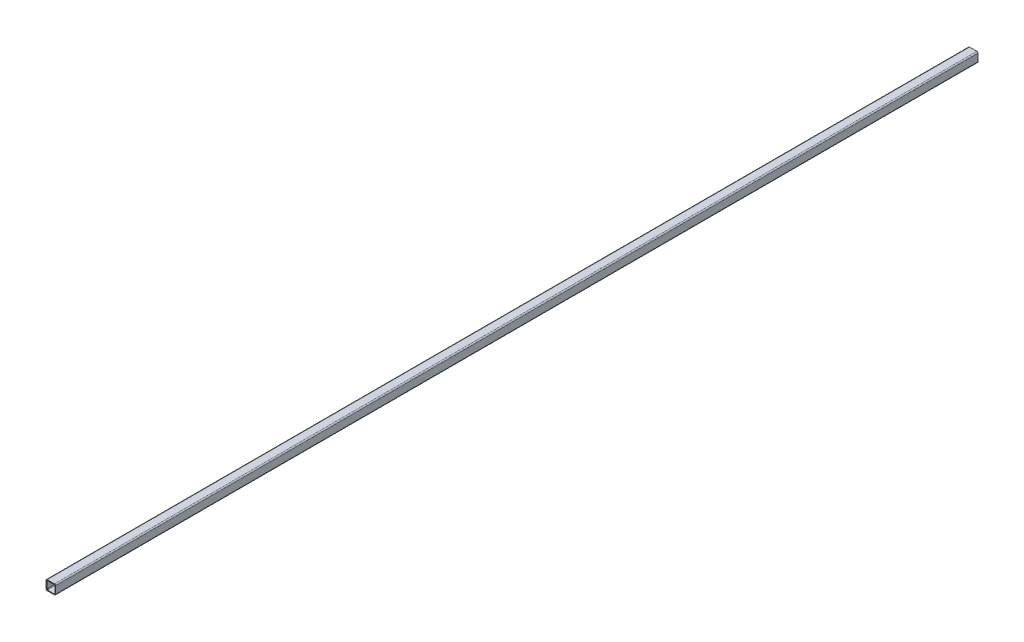
ISO-10303-21;
HEADER;
FILE_DESCRIPTION(('STEP AP214'),'2;1');
FILE_NAME('part.step','',(''),(''),'','','');
FILE_SCHEMA(('AUTOMOTIVE_DESIGN { 1 0 10303 214 1 1 1 1 }'));
ENDSEC;
DATA;
#1=APPLICATION_CONTEXT('core data for automotive mechanical design processes');
#2=APPLICATION_PROTOCOL_DEFINITION('international standard','automotive_design',2000,#1);
#3=PRODUCT_CONTEXT('',#1,'mechanical');
#4=PRODUCT('Part','Part','',(#3));
#5=PRODUCT_RELATED_PRODUCT_CATEGORY('part','',(#4));
#6=PRODUCT_DEFINITION_FORMATION('','',#4);
#7=PRODUCT_DEFINITION_CONTEXT('part definition',#1,'design');
#8=PRODUCT_DEFINITION('design','',#6,#7);
#9=PRODUCT_DEFINITION_SHAPE('','',#8);
#10=(LENGTH_UNIT() NAMED_UNIT(*) SI_UNIT(.MILLI.,.METRE.));
#11=(NAMED_UNIT(*) PLANE_ANGLE_UNIT() SI_UNIT($,.RADIAN.));
#12=(NAMED_UNIT(*) SI_UNIT($,.STERADIAN.) SOLID_ANGLE_UNIT());
#13=UNCERTAINTY_MEASURE_WITH_UNIT(LENGTH_MEASURE(1.E-05),#10,'distance_accuracy_value','');
#14=(GEOMETRIC_REPRESENTATION_CONTEXT(3) GLOBAL_UNCERTAINTY_ASSIGNED_CONTEXT((#13)) GLOBAL_UNIT_ASSIGNED_CONTEXT((#10,
#11,#12)) REPRESENTATION_CONTEXT('',''));
#15=CARTESIAN_POINT('',(0.,0.,0.));
#16=DIRECTION('',(0.,0.,1.));
#17=DIRECTION('',(1.,0.,0.));
#18=AXIS2_PLACEMENT_3D('',#15,#16,#17);
#19=CARTESIAN_POINT('',(0.,0.,1219.2));
#20=DIRECTION('',(0.,0.,1.));
#21=DIRECTION('',(1.,0.,0.));
#22=AXIS2_PLACEMENT_3D('',#19,#20,#21);
#23=PLANE('',#22);
#24=DIRECTION('',(0.,-1.,0.));
#25=VECTOR('',#24,1.);
#26=CARTESIAN_POINT('',(-12.7,-12.7,1219.2));
#27=LINE('',#26,#25);
#28=CARTESIAN_POINT('',(-12.7,9.52499999999999,1219.2));
#29=VERTEX_POINT('',#28);
#30=CARTESIAN_POINT('',(-12.7,-9.525,1219.2));
#31=VERTEX_POINT('',#30);
#32=EDGE_CURVE('E219',#29,#31,#27,.T.);
#33=ORIENTED_EDGE('',*,*,#32,.T.);
#34=CARTESIAN_POINT('',(-9.525,-9.525,1219.2));
#35=DIRECTION('',(0.,0.,1.));
#36=DIRECTION('',(1.,0.,0.));
#37=AXIS2_PLACEMENT_3D('',#34,#35,#36);
#38=CIRCLE('',#37,3.175);
#39=CARTESIAN_POINT('',(-9.525,-12.7,1219.2));
#40=VERTEX_POINT('',#39);
#41=EDGE_CURVE('E248',#31,#40,#38,.T.);
#42=ORIENTED_EDGE('',*,*,#41,.T.);
#43=DIRECTION('',(1.,0.,0.));
#44=VECTOR('',#43,1.);
#45=CARTESIAN_POINT('',(12.7,-12.7,1219.2));
#46=LINE('',#45,#44);
#47=CARTESIAN_POINT('',(9.525,-12.7,1219.2));
#48=VERTEX_POINT('',#47);
#49=EDGE_CURVE('E181',#40,#48,#46,.T.);
#50=ORIENTED_EDGE('',*,*,#49,.T.);
#51=CARTESIAN_POINT('',(9.525,-9.525,1219.2));
#52=DIRECTION('',(0.,0.,1.));
#53=DIRECTION('',(1.,0.,0.));
#54=AXIS2_PLACEMENT_3D('',#51,#52,#53);
#55=CIRCLE('',#54,3.175);
#56=CARTESIAN_POINT('',(12.7,-9.525,1219.2));
#57=VERTEX_POINT('',#56);
#58=EDGE_CURVE('E245',#48,#57,#55,.T.);
#59=ORIENTED_EDGE('',*,*,#58,.T.);
#60=DIRECTION('',(0.,1.,0.));
#61=VECTOR('',#60,1.);
#62=CARTESIAN_POINT('',(12.7,-12.7,1219.2));
#63=LINE('',#62,#61);
#64=CARTESIAN_POINT('',(12.7,9.525,1219.2));
#65=VERTEX_POINT('',#64);
#66=EDGE_CURVE('E211',#57,#65,#63,.T.);
#67=ORIENTED_EDGE('',*,*,#66,.T.);
#68=CARTESIAN_POINT('',(9.525,9.525,1219.2));
#69=DIRECTION('',(0.,0.,1.));
#70=DIRECTION('',(1.,0.,0.));
#71=AXIS2_PLACEMENT_3D('',#68,#69,#70);
#72=CIRCLE('',#71,3.175);
#73=CARTESIAN_POINT('',(9.525,12.7,1219.2));
#74=VERTEX_POINT('',#73);
#75=EDGE_CURVE('E239',#65,#74,#72,.T.);
#76=ORIENTED_EDGE('',*,*,#75,.T.);
#77=DIRECTION('',(-1.,0.,0.));
#78=VECTOR('',#77,1.);
#79=CARTESIAN_POINT('',(12.7,12.7,1219.2));
#80=LINE('',#79,#78);
#81=CARTESIAN_POINT('',(-9.525,12.7,1219.2));
#82=VERTEX_POINT('',#81);
#83=EDGE_CURVE('E215',#74,#82,#80,.T.);
#84=ORIENTED_EDGE('',*,*,#83,.T.);
#85=CARTESIAN_POINT('',(-9.525,9.52499999999999,1219.2));
#86=DIRECTION('',(0.,0.,1.));
#87=DIRECTION('',(1.,0.,0.));
#88=AXIS2_PLACEMENT_3D('',#85,#86,#87);
#89=CIRCLE('',#88,3.175);
#90=EDGE_CURVE('E242',#82,#29,#89,.T.);
#91=ORIENTED_EDGE('',*,*,#90,.T.);
#92=EDGE_LOOP('',(#33,#42,#50,#59,#67,#76,#84,#91));
#93=FACE_BOUND('',#92,.T.);
#94=DIRECTION('',(-1.,0.,0.));
#95=VECTOR('',#94,1.);
#96=CARTESIAN_POINT('',(10.668,10.668,1219.2));
#97=LINE('',#96,#95);
#98=CARTESIAN_POINT('',(9.0805,10.668,1219.2));
#99=VERTEX_POINT('',#98);
#100=CARTESIAN_POINT('',(-9.0805,10.668,1219.2));
#101=VERTEX_POINT('',#100);
#102=EDGE_CURVE('E195',#99,#101,#97,.T.);
#103=ORIENTED_EDGE('',*,*,#102,.F.);
#104=CARTESIAN_POINT('',(9.0805,9.0805,1219.2));
#105=DIRECTION('',(0.,0.,1.));
#106=DIRECTION('',(1.,0.,0.));
#107=AXIS2_PLACEMENT_3D('',#104,#105,#106);
#108=CIRCLE('',#107,1.5875);
#109=CARTESIAN_POINT('',(10.668,9.0805,1219.2));
#110=VERTEX_POINT('',#109);
#111=EDGE_CURVE('E301',#99,#110,#108,.F.);
#112=ORIENTED_EDGE('',*,*,#111,.T.);
#113=DIRECTION('',(0.,1.,0.));
#114=VECTOR('',#113,1.);
#115=CARTESIAN_POINT('',(10.668,-10.668,1219.2));
#116=LINE('',#115,#114);
#117=CARTESIAN_POINT('',(10.668,-9.0805,1219.2));
#118=VERTEX_POINT('',#117);
#119=EDGE_CURVE('E189',#118,#110,#116,.T.);
#120=ORIENTED_EDGE('',*,*,#119,.F.);
#121=CARTESIAN_POINT('',(9.0805,-9.0805,1219.2));
#122=DIRECTION('',(0.,0.,1.));
#123=DIRECTION('',(1.,0.,0.));
#124=AXIS2_PLACEMENT_3D('',#121,#122,#123);
#125=CIRCLE('',#124,1.5875);
#126=CARTESIAN_POINT('',(9.0805,-10.668,1219.2));
#127=VERTEX_POINT('',#126);
#128=EDGE_CURVE('E295',#118,#127,#125,.F.);
#129=ORIENTED_EDGE('',*,*,#128,.T.);
#130=DIRECTION('',(1.,0.,0.));
#131=VECTOR('',#130,1.);
#132=CARTESIAN_POINT('',(10.668,-10.668,1219.2));
#133=LINE('',#132,#131);
#134=CARTESIAN_POINT('',(-9.0805,-10.668,1219.2));
#135=VERTEX_POINT('',#134);
#136=EDGE_CURVE('E207',#135,#127,#133,.T.);
#137=ORIENTED_EDGE('',*,*,#136,.F.);
#138=CARTESIAN_POINT('',(-9.0805,-9.0805,1219.2));
#139=DIRECTION('',(0.,0.,1.));
#140=DIRECTION('',(1.,0.,0.));
#141=AXIS2_PLACEMENT_3D('',#138,#139,#140);
#142=CIRCLE('',#141,1.5875);
#143=CARTESIAN_POINT('',(-10.668,-9.0805,1219.2));
#144=VERTEX_POINT('',#143);
#145=EDGE_CURVE('E61',#135,#144,#142,.F.);
#146=ORIENTED_EDGE('',*,*,#145,.T.);
#147=DIRECTION('',(0.,-1.,0.));
#148=VECTOR('',#147,1.);
#149=CARTESIAN_POINT('',(-10.668,-10.668,1219.2));
#150=LINE('',#149,#148);
#151=CARTESIAN_POINT('',(-10.668,9.0805,1219.2));
#152=VERTEX_POINT('',#151);
#153=EDGE_CURVE('E204',#152,#144,#150,.T.);
#154=ORIENTED_EDGE('',*,*,#153,.F.);
#155=CARTESIAN_POINT('',(-9.0805,9.0805,1219.2));
#156=DIRECTION('',(0.,0.,1.));
#157=DIRECTION('',(1.,0.,0.));
#158=AXIS2_PLACEMENT_3D('',#155,#156,#157);
#159=CIRCLE('',#158,1.5875);
#160=EDGE_CURVE('E11',#152,#101,#159,.F.);
#161=ORIENTED_EDGE('',*,*,#160,.T.);
#162=EDGE_LOOP('',(#103,#112,#120,#129,#137,#146,#154,#161));
#163=FACE_BOUND('',#162,.T.);
#164=ADVANCED_FACE('F45',(#93,#163),#23,.T.);
#165=CARTESIAN_POINT('',(12.7,-12.7,1219.2));
#166=DIRECTION('',(-1.,0.,0.));
#167=DIRECTION('',(0.,-1.,0.));
#168=AXIS2_PLACEMENT_3D('',#165,#166,#167);
#169=PLANE('',#168);
#170=ORIENTED_EDGE('',*,*,#66,.F.);
#171=DIRECTION('',(0.,0.,-1.));
#172=VECTOR('',#171,1.);
#173=CARTESIAN_POINT('',(12.7,-9.525,1219.2));
#174=LINE('',#173,#172);
#175=CARTESIAN_POINT('',(12.7,-9.525,-1219.2));
#176=VERTEX_POINT('',#175);
#177=EDGE_CURVE('E254',#57,#176,#174,.T.);
#178=ORIENTED_EDGE('',*,*,#177,.T.);
#179=DIRECTION('',(0.,1.,0.));
#180=VECTOR('',#179,1.);
#181=CARTESIAN_POINT('',(12.7,-12.7,-1219.2));
#182=LINE('',#181,#180);
#183=CARTESIAN_POINT('',(12.7,9.525,-1219.2));
#184=VERTEX_POINT('',#183);
#185=EDGE_CURVE('E350',#176,#184,#182,.T.);
#186=ORIENTED_EDGE('',*,*,#185,.T.);
#187=DIRECTION('',(0.,0.,-1.));
#188=VECTOR('',#187,1.);
#189=CARTESIAN_POINT('',(12.7,9.525,1219.2));
#190=LINE('',#189,#188);
#191=EDGE_CURVE('E251',#184,#65,#190,.F.);
#192=ORIENTED_EDGE('',*,*,#191,.T.);
#193=EDGE_LOOP('',(#170,#178,#186,#192));
#194=FACE_BOUND('',#193,.T.);
#195=ADVANCED_FACE('F379',(#194),#169,.F.);
#196=CARTESIAN_POINT('',(12.7,12.7,1219.2));
#197=DIRECTION('',(0.,-1.,0.));
#198=DIRECTION('',(1.,0.,0.));
#199=AXIS2_PLACEMENT_3D('',#196,#197,#198);
#200=PLANE('',#199);
#201=DIRECTION('',(-1.,0.,0.));
#202=VECTOR('',#201,1.);
#203=CARTESIAN_POINT('',(12.7,12.7,-1219.2));
#204=LINE('',#203,#202);
#205=CARTESIAN_POINT('',(9.525,12.7,-1219.2));
#206=VERTEX_POINT('',#205);
#207=CARTESIAN_POINT('',(-9.525,12.7,-1219.2));
#208=VERTEX_POINT('',#207);
#209=EDGE_CURVE('E197',#206,#208,#204,.T.);
#210=ORIENTED_EDGE('',*,*,#209,.T.);
#211=DIRECTION('',(0.,0.,-1.));
#212=VECTOR('',#211,1.);
#213=CARTESIAN_POINT('',(-9.525,12.7,1219.2));
#214=LINE('',#213,#212);
#215=EDGE_CURVE('E262',#208,#82,#214,.F.);
#216=ORIENTED_EDGE('',*,*,#215,.T.);
#217=ORIENTED_EDGE('',*,*,#83,.F.);
#218=DIRECTION('',(0.,0.,-1.));
#219=VECTOR('',#218,1.);
#220=CARTESIAN_POINT('',(9.525,12.7,1219.2));
#221=LINE('',#220,#219);
#222=EDGE_CURVE('E258',#74,#206,#221,.T.);
#223=ORIENTED_EDGE('',*,*,#222,.T.);
#224=EDGE_LOOP('',(#210,#216,#217,#223));
#225=FACE_BOUND('',#224,.T.);
#226=ADVANCED_FACE('F361',(#225),#200,.F.);
#227=CARTESIAN_POINT('',(-12.7,-12.7,1219.2));
#228=DIRECTION('',(1.,0.,0.));
#229=DIRECTION('',(0.,0.,-1.));
#230=AXIS2_PLACEMENT_3D('',#227,#228,#229);
#231=PLANE('',#230);
#232=DIRECTION('',(0.,-1.,0.));
#233=VECTOR('',#232,1.);
#234=CARTESIAN_POINT('',(-12.7,-12.7,-1219.2));
#235=LINE('',#234,#233);
#236=CARTESIAN_POINT('',(-12.7,9.52499999999999,-1219.2));
#237=VERTEX_POINT('',#236);
#238=CARTESIAN_POINT('',(-12.7,-9.525,-1219.2));
#239=VERTEX_POINT('',#238);
#240=EDGE_CURVE('E190',#237,#239,#235,.T.);
#241=ORIENTED_EDGE('',*,*,#240,.T.);
#242=DIRECTION('',(0.,0.,-1.));
#243=VECTOR('',#242,1.);
#244=CARTESIAN_POINT('',(-12.7,-9.525,1219.2));
#245=LINE('',#244,#243);
#246=EDGE_CURVE('E165',#239,#31,#245,.F.);
#247=ORIENTED_EDGE('',*,*,#246,.T.);
#248=ORIENTED_EDGE('',*,*,#32,.F.);
#249=DIRECTION('',(0.,0.,-1.));
#250=VECTOR('',#249,1.);
#251=CARTESIAN_POINT('',(-12.7,9.52499999999999,1219.2));
#252=LINE('',#251,#250);
#253=EDGE_CURVE('E171',#29,#237,#252,.T.);
#254=ORIENTED_EDGE('',*,*,#253,.T.);
#255=EDGE_LOOP('',(#241,#247,#248,#254));
#256=FACE_BOUND('',#255,.T.);
#257=ADVANCED_FACE('F371',(#256),#231,.F.);
#258=CARTESIAN_POINT('',(12.7,-12.7,1219.2));
#259=DIRECTION('',(0.,1.,0.));
#260=DIRECTION('',(-1.,0.,0.));
#261=AXIS2_PLACEMENT_3D('',#258,#259,#260);
#262=PLANE('',#261);
#263=ORIENTED_EDGE('',*,*,#49,.F.);
#264=DIRECTION('',(0.,0.,-1.));
#265=VECTOR('',#264,1.);
#266=CARTESIAN_POINT('',(-9.525,-12.7,1219.2));
#267=LINE('',#266,#265);
#268=CARTESIAN_POINT('',(-9.525,-12.7,-1219.2));
#269=VERTEX_POINT('',#268);
#270=EDGE_CURVE('E164',#40,#269,#267,.T.);
#271=ORIENTED_EDGE('',*,*,#270,.T.);
#272=DIRECTION('',(1.,0.,0.));
#273=VECTOR('',#272,1.);
#274=CARTESIAN_POINT('',(12.7,-12.7,-1219.2));
#275=LINE('',#274,#273);
#276=CARTESIAN_POINT('',(9.525,-12.7,-1219.2));
#277=VERTEX_POINT('',#276);
#278=EDGE_CURVE('E178',#269,#277,#275,.T.);
#279=ORIENTED_EDGE('',*,*,#278,.T.);
#280=DIRECTION('',(0.,0.,-1.));
#281=VECTOR('',#280,1.);
#282=CARTESIAN_POINT('',(9.525,-12.7,1219.2));
#283=LINE('',#282,#281);
#284=EDGE_CURVE('E184',#277,#48,#283,.F.);
#285=ORIENTED_EDGE('',*,*,#284,.T.);
#286=EDGE_LOOP('',(#263,#271,#279,#285));
#287=FACE_BOUND('',#286,.T.);
#288=ADVANCED_FACE('F177',(#287),#262,.F.);
#289=CARTESIAN_POINT('',(10.668,-10.668,1219.2));
#290=DIRECTION('',(-1.,0.,0.));
#291=DIRECTION('',(0.,0.,1.));
#292=AXIS2_PLACEMENT_3D('',#289,#290,#291);
#293=PLANE('',#292);
#294=DIRECTION('',(0.,1.,0.));
#295=VECTOR('',#294,1.);
#296=CARTESIAN_POINT('',(10.668,-10.668,-1219.2));
#297=LINE('',#296,#295);
#298=CARTESIAN_POINT('',(10.668,-9.0805,-1219.2));
#299=VERTEX_POINT('',#298);
#300=CARTESIAN_POINT('',(10.668,9.0805,-1219.2));
#301=VERTEX_POINT('',#300);
#302=EDGE_CURVE('E338',#299,#301,#297,.T.);
#303=ORIENTED_EDGE('',*,*,#302,.F.);
#304=DIRECTION('',(0.,0.,-1.));
#305=VECTOR('',#304,1.);
#306=CARTESIAN_POINT('',(10.668,-9.0805,1219.2));
#307=LINE('',#306,#305);
#308=EDGE_CURVE('E276',#299,#118,#307,.F.);
#309=ORIENTED_EDGE('',*,*,#308,.T.);
#310=ORIENTED_EDGE('',*,*,#119,.T.);
#311=DIRECTION('',(0.,0.,-1.));
#312=VECTOR('',#311,1.);
#313=CARTESIAN_POINT('',(10.668,9.0805,-1219.2));
#314=LINE('',#313,#312);
#315=EDGE_CURVE('E272',#110,#301,#314,.T.);
#316=ORIENTED_EDGE('',*,*,#315,.T.);
#317=EDGE_LOOP('',(#303,#309,#310,#316));
#318=FACE_BOUND('',#317,.T.);
#319=ADVANCED_FACE('F335',(#318),#293,.T.);
#320=CARTESIAN_POINT('',(10.668,10.668,1219.2));
#321=DIRECTION('',(0.,-1.,0.));
#322=DIRECTION('',(1.,0.,0.));
#323=AXIS2_PLACEMENT_3D('',#320,#321,#322);
#324=PLANE('',#323);
#325=DIRECTION('',(-1.,0.,0.));
#326=VECTOR('',#325,1.);
#327=CARTESIAN_POINT('',(10.668,10.668,-1219.2));
#328=LINE('',#327,#326);
#329=CARTESIAN_POINT('',(9.0805,10.668,-1219.2));
#330=VERTEX_POINT('',#329);
#331=CARTESIAN_POINT('',(-9.0805,10.668,-1219.2));
#332=VERTEX_POINT('',#331);
#333=EDGE_CURVE('E314',#330,#332,#328,.T.);
#334=ORIENTED_EDGE('',*,*,#333,.F.);
#335=DIRECTION('',(0.,0.,-1.));
#336=VECTOR('',#335,1.);
#337=CARTESIAN_POINT('',(9.0805,10.668,1219.2));
#338=LINE('',#337,#336);
#339=EDGE_CURVE('E283',#330,#99,#338,.F.);
#340=ORIENTED_EDGE('',*,*,#339,.T.);
#341=ORIENTED_EDGE('',*,*,#102,.T.);
#342=DIRECTION('',(0.,0.,-1.));
#343=VECTOR('',#342,1.);
#344=CARTESIAN_POINT('',(-9.0805,10.668,-1219.2));
#345=LINE('',#344,#343);
#346=EDGE_CURVE('E279',#101,#332,#345,.T.);
#347=ORIENTED_EDGE('',*,*,#346,.T.);
#348=EDGE_LOOP('',(#334,#340,#341,#347));
#349=FACE_BOUND('',#348,.T.);
#350=ADVANCED_FACE('F326',(#349),#324,.T.);
#351=CARTESIAN_POINT('',(-10.668,-10.668,1219.2));
#352=DIRECTION('',(1.,0.,0.));
#353=DIRECTION('',(0.,0.,-1.));
#354=AXIS2_PLACEMENT_3D('',#351,#352,#353);
#355=PLANE('',#354);
#356=ORIENTED_EDGE('',*,*,#153,.T.);
#357=DIRECTION('',(0.,0.,-1.));
#358=VECTOR('',#357,1.);
#359=CARTESIAN_POINT('',(-10.668,-9.0805,-1219.2));
#360=LINE('',#359,#358);
#361=CARTESIAN_POINT('',(-10.668,-9.0805,-1219.2));
#362=VERTEX_POINT('',#361);
#363=EDGE_CURVE('E288',#144,#362,#360,.T.);
#364=ORIENTED_EDGE('',*,*,#363,.T.);
#365=DIRECTION('',(0.,-1.,0.));
#366=VECTOR('',#365,1.);
#367=CARTESIAN_POINT('',(-10.668,-10.668,-1219.2));
#368=LINE('',#367,#366);
#369=CARTESIAN_POINT('',(-10.668,9.0805,-1219.2));
#370=VERTEX_POINT('',#369);
#371=EDGE_CURVE('E312',#370,#362,#368,.T.);
#372=ORIENTED_EDGE('',*,*,#371,.F.);
#373=DIRECTION('',(0.,0.,-1.));
#374=VECTOR('',#373,1.);
#375=CARTESIAN_POINT('',(-10.668,9.0805,1219.2));
#376=LINE('',#375,#374);
#377=EDGE_CURVE('E68',#370,#152,#376,.F.);
#378=ORIENTED_EDGE('',*,*,#377,.T.);
#379=EDGE_LOOP('',(#356,#364,#372,#378));
#380=FACE_BOUND('',#379,.T.);
#381=ADVANCED_FACE('F317',(#380),#355,.T.);
#382=CARTESIAN_POINT('',(10.668,-10.668,1219.2));
#383=DIRECTION('',(0.,1.,0.));
#384=DIRECTION('',(-1.,0.,0.));
#385=AXIS2_PLACEMENT_3D('',#382,#383,#384);
#386=PLANE('',#385);
#387=ORIENTED_EDGE('',*,*,#136,.T.);
#388=DIRECTION('',(0.,0.,-1.));
#389=VECTOR('',#388,1.);
#390=CARTESIAN_POINT('',(9.0805,-10.668,-1219.2));
#391=LINE('',#390,#389);
#392=CARTESIAN_POINT('',(9.0805,-10.668,-1219.2));
#393=VERTEX_POINT('',#392);
#394=EDGE_CURVE('E268',#127,#393,#391,.T.);
#395=ORIENTED_EDGE('',*,*,#394,.T.);
#396=DIRECTION('',(1.,0.,0.));
#397=VECTOR('',#396,1.);
#398=CARTESIAN_POINT('',(10.668,-10.668,-1219.2));
#399=LINE('',#398,#397);
#400=CARTESIAN_POINT('',(-9.0805,-10.668,-1219.2));
#401=VERTEX_POINT('',#400);
#402=EDGE_CURVE('E320',#401,#393,#399,.T.);
#403=ORIENTED_EDGE('',*,*,#402,.F.);
#404=DIRECTION('',(0.,0.,-1.));
#405=VECTOR('',#404,1.);
#406=CARTESIAN_POINT('',(-9.0805,-10.668,1219.2));
#407=LINE('',#406,#405);
#408=EDGE_CURVE('E265',#401,#135,#407,.F.);
#409=ORIENTED_EDGE('',*,*,#408,.T.);
#410=EDGE_LOOP('',(#387,#395,#403,#409));
#411=FACE_BOUND('',#410,.T.);
#412=ADVANCED_FACE('F343',(#411),#386,.T.);
#413=CARTESIAN_POINT('',(0.,0.,-1219.2));
#414=DIRECTION('',(0.,0.,1.));
#415=DIRECTION('',(1.,0.,0.));
#416=AXIS2_PLACEMENT_3D('',#413,#414,#415);
#417=PLANE('',#416);
#418=ORIENTED_EDGE('',*,*,#371,.T.);
#419=CARTESIAN_POINT('',(-9.0805,-9.0805,-1219.2));
#420=DIRECTION('',(0.,0.,1.));
#421=DIRECTION('',(1.,0.,0.));
#422=AXIS2_PLACEMENT_3D('',#419,#420,#421);
#423=CIRCLE('',#422,1.5875);
#424=EDGE_CURVE('E304',#362,#401,#423,.T.);
#425=ORIENTED_EDGE('',*,*,#424,.T.);
#426=ORIENTED_EDGE('',*,*,#402,.T.);
#427=CARTESIAN_POINT('',(9.0805,-9.0805,-1219.2));
#428=DIRECTION('',(0.,0.,1.));
#429=DIRECTION('',(1.,0.,0.));
#430=AXIS2_PLACEMENT_3D('',#427,#428,#429);
#431=CIRCLE('',#430,1.5875);
#432=EDGE_CURVE('E292',#393,#299,#431,.T.);
#433=ORIENTED_EDGE('',*,*,#432,.T.);
#434=ORIENTED_EDGE('',*,*,#302,.T.);
#435=CARTESIAN_POINT('',(9.0805,9.0805,-1219.2));
#436=DIRECTION('',(0.,0.,1.));
#437=DIRECTION('',(1.,0.,0.));
#438=AXIS2_PLACEMENT_3D('',#435,#436,#437);
#439=CIRCLE('',#438,1.5875);
#440=EDGE_CURVE('E298',#301,#330,#439,.T.);
#441=ORIENTED_EDGE('',*,*,#440,.T.);
#442=ORIENTED_EDGE('',*,*,#333,.T.);
#443=CARTESIAN_POINT('',(-9.0805,9.0805,-1219.2));
#444=DIRECTION('',(0.,0.,1.));
#445=DIRECTION('',(1.,0.,0.));
#446=AXIS2_PLACEMENT_3D('',#443,#444,#445);
#447=CIRCLE('',#446,1.5875);
#448=EDGE_CURVE('E54',#332,#370,#447,.T.);
#449=ORIENTED_EDGE('',*,*,#448,.T.);
#450=EDGE_LOOP('',(#418,#425,#426,#433,#434,#441,#442,#449));
#451=FACE_BOUND('',#450,.T.);
#452=ORIENTED_EDGE('',*,*,#278,.F.);
#453=CARTESIAN_POINT('',(-9.525,-9.525,-1219.2));
#454=DIRECTION('',(0.,0.,1.));
#455=DIRECTION('',(1.,0.,0.));
#456=AXIS2_PLACEMENT_3D('',#453,#454,#455);
#457=CIRCLE('',#456,3.175);
#458=EDGE_CURVE('E160',#269,#239,#457,.F.);
#459=ORIENTED_EDGE('',*,*,#458,.T.);
#460=ORIENTED_EDGE('',*,*,#240,.F.);
#461=CARTESIAN_POINT('',(-9.525,9.52499999999999,-1219.2));
#462=DIRECTION('',(0.,0.,1.));
#463=DIRECTION('',(1.,0.,0.));
#464=AXIS2_PLACEMENT_3D('',#461,#462,#463);
#465=CIRCLE('',#464,3.175);
#466=EDGE_CURVE('E229',#237,#208,#465,.F.);
#467=ORIENTED_EDGE('',*,*,#466,.T.);
#468=ORIENTED_EDGE('',*,*,#209,.F.);
#469=CARTESIAN_POINT('',(9.525,9.525,-1219.2));
#470=DIRECTION('',(0.,0.,1.));
#471=DIRECTION('',(1.,0.,0.));
#472=AXIS2_PLACEMENT_3D('',#469,#470,#471);
#473=CIRCLE('',#472,3.175);
#474=EDGE_CURVE('E183',#206,#184,#473,.F.);
#475=ORIENTED_EDGE('',*,*,#474,.T.);
#476=ORIENTED_EDGE('',*,*,#185,.F.);
#477=CARTESIAN_POINT('',(9.525,-9.525,-1219.2));
#478=DIRECTION('',(0.,0.,1.));
#479=DIRECTION('',(1.,0.,0.));
#480=AXIS2_PLACEMENT_3D('',#477,#478,#479);
#481=CIRCLE('',#480,3.175);
#482=EDGE_CURVE('E172',#176,#277,#481,.F.);
#483=ORIENTED_EDGE('',*,*,#482,.T.);
#484=EDGE_LOOP('',(#452,#459,#460,#467,#468,#475,#476,#483));
#485=FACE_BOUND('',#484,.T.);
#486=ADVANCED_FACE('F186',(#451,#485),#417,.F.);
#487=CARTESIAN_POINT('',(-9.525,-9.525,1219.2));
#488=DIRECTION('',(0.,0.,-1.));
#489=DIRECTION('',(-1.,0.,0.));
#490=AXIS2_PLACEMENT_3D('',#487,#488,#489);
#491=CYLINDRICAL_SURFACE('',#490,3.175);
#492=ORIENTED_EDGE('',*,*,#41,.F.);
#493=ORIENTED_EDGE('',*,*,#246,.F.);
#494=ORIENTED_EDGE('',*,*,#458,.F.);
#495=ORIENTED_EDGE('',*,*,#270,.F.);
#496=EDGE_LOOP('',(#492,#493,#494,#495));
#497=FACE_BOUND('',#496,.T.);
#498=ADVANCED_FACE('F163',(#497),#491,.T.);
#499=CARTESIAN_POINT('',(9.525,-9.525,1219.2));
#500=DIRECTION('',(0.,0.,-1.));
#501=DIRECTION('',(-1.,0.,0.));
#502=AXIS2_PLACEMENT_3D('',#499,#500,#501);
#503=CYLINDRICAL_SURFACE('',#502,3.175);
#504=ORIENTED_EDGE('',*,*,#58,.F.);
#505=ORIENTED_EDGE('',*,*,#284,.F.);
#506=ORIENTED_EDGE('',*,*,#482,.F.);
#507=ORIENTED_EDGE('',*,*,#177,.F.);
#508=EDGE_LOOP('',(#504,#505,#506,#507));
#509=FACE_BOUND('',#508,.T.);
#510=ADVANCED_FACE('F401',(#509),#503,.T.);
#511=CARTESIAN_POINT('',(-9.525,9.52499999999999,1219.2));
#512=DIRECTION('',(0.,0.,-1.));
#513=DIRECTION('',(-1.,0.,0.));
#514=AXIS2_PLACEMENT_3D('',#511,#512,#513);
#515=CYLINDRICAL_SURFACE('',#514,3.175);
#516=ORIENTED_EDGE('',*,*,#90,.F.);
#517=ORIENTED_EDGE('',*,*,#215,.F.);
#518=ORIENTED_EDGE('',*,*,#466,.F.);
#519=ORIENTED_EDGE('',*,*,#253,.F.);
#520=EDGE_LOOP('',(#516,#517,#518,#519));
#521=FACE_BOUND('',#520,.T.);
#522=ADVANCED_FACE('F366',(#521),#515,.T.);
#523=CARTESIAN_POINT('',(9.525,9.525,1219.2));
#524=DIRECTION('',(0.,0.,-1.));
#525=DIRECTION('',(-1.,0.,0.));
#526=AXIS2_PLACEMENT_3D('',#523,#524,#525);
#527=CYLINDRICAL_SURFACE('',#526,3.175);
#528=ORIENTED_EDGE('',*,*,#75,.F.);
#529=ORIENTED_EDGE('',*,*,#191,.F.);
#530=ORIENTED_EDGE('',*,*,#474,.F.);
#531=ORIENTED_EDGE('',*,*,#222,.F.);
#532=EDGE_LOOP('',(#528,#529,#530,#531));
#533=FACE_BOUND('',#532,.T.);
#534=ADVANCED_FACE('F411',(#533),#527,.T.);
#535=CARTESIAN_POINT('',(9.0805,-9.0805,1219.2));
#536=DIRECTION('',(0.,0.,1.));
#537=DIRECTION('',(1.,0.,0.));
#538=AXIS2_PLACEMENT_3D('',#535,#536,#537);
#539=CYLINDRICAL_SURFACE('',#538,1.5875);
#540=ORIENTED_EDGE('',*,*,#128,.F.);
#541=ORIENTED_EDGE('',*,*,#308,.F.);
#542=ORIENTED_EDGE('',*,*,#432,.F.);
#543=ORIENTED_EDGE('',*,*,#394,.F.);
#544=EDGE_LOOP('',(#540,#541,#542,#543));
#545=FACE_BOUND('',#544,.T.);
#546=ADVANCED_FACE('F340',(#545),#539,.F.);
#547=CARTESIAN_POINT('',(9.0805,9.0805,1219.2));
#548=DIRECTION('',(0.,0.,1.));
#549=DIRECTION('',(1.,0.,0.));
#550=AXIS2_PLACEMENT_3D('',#547,#548,#549);
#551=CYLINDRICAL_SURFACE('',#550,1.5875);
#552=ORIENTED_EDGE('',*,*,#111,.F.);
#553=ORIENTED_EDGE('',*,*,#339,.F.);
#554=ORIENTED_EDGE('',*,*,#440,.F.);
#555=ORIENTED_EDGE('',*,*,#315,.F.);
#556=EDGE_LOOP('',(#552,#553,#554,#555));
#557=FACE_BOUND('',#556,.T.);
#558=ADVANCED_FACE('F329',(#557),#551,.F.);
#559=CARTESIAN_POINT('',(-9.0805,-9.0805,1219.2));
#560=DIRECTION('',(0.,0.,1.));
#561=DIRECTION('',(1.,0.,0.));
#562=AXIS2_PLACEMENT_3D('',#559,#560,#561);
#563=CYLINDRICAL_SURFACE('',#562,1.5875);
#564=ORIENTED_EDGE('',*,*,#145,.F.);
#565=ORIENTED_EDGE('',*,*,#408,.F.);
#566=ORIENTED_EDGE('',*,*,#424,.F.);
#567=ORIENTED_EDGE('',*,*,#363,.F.);
#568=EDGE_LOOP('',(#564,#565,#566,#567));
#569=FACE_BOUND('',#568,.T.);
#570=ADVANCED_FACE('F348',(#569),#563,.F.);
#571=CARTESIAN_POINT('',(-9.0805,9.0805,1219.2));
#572=DIRECTION('',(0.,0.,1.));
#573=DIRECTION('',(1.,0.,0.));
#574=AXIS2_PLACEMENT_3D('',#571,#572,#573);
#575=CYLINDRICAL_SURFACE('',#574,1.5875);
#576=ORIENTED_EDGE('',*,*,#160,.F.);
#577=ORIENTED_EDGE('',*,*,#377,.F.);
#578=ORIENTED_EDGE('',*,*,#448,.F.);
#579=ORIENTED_EDGE('',*,*,#346,.F.);
#580=EDGE_LOOP('',(#576,#577,#578,#579));
#581=FACE_BOUND('',#580,.T.);
#582=ADVANCED_FACE('F47',(#581),#575,.F.);
#583=CLOSED_SHELL('',(#164,#195,#226,#257,#288,#319,#350,#381,#412,#486,#498,#510,#522,#534,
#546,#558,#570,#582));
#584=MANIFOLD_SOLID_BREP('B2',#583);
#585=ADVANCED_BREP_SHAPE_REPRESENTATION('',(#18,#584),#14);
#586=SHAPE_DEFINITION_REPRESENTATION(#9,#585);
ENDSEC;
END-ISO-10303-21;
